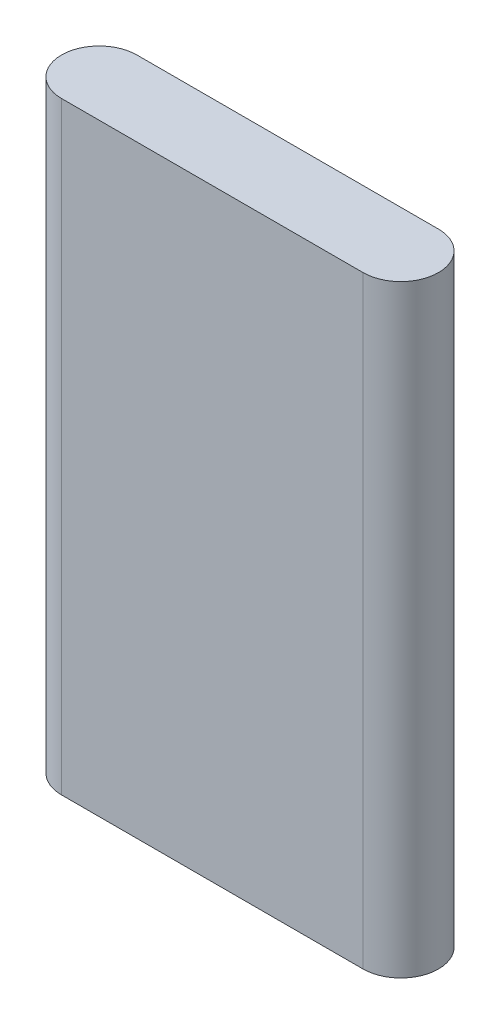
ISO-10303-21;
HEADER;
FILE_DESCRIPTION(('STEP AP214'),'2;1');
FILE_NAME('part.step','',(''),(''),'','','');
FILE_SCHEMA(('AUTOMOTIVE_DESIGN { 1 0 10303 214 1 1 1 1 }'));
ENDSEC;
DATA;
#1=APPLICATION_CONTEXT('core data for automotive mechanical design processes');
#2=APPLICATION_PROTOCOL_DEFINITION('international standard','automotive_design',2000,#1);
#3=PRODUCT_CONTEXT('',#1,'mechanical');
#4=PRODUCT('Part','Part','',(#3));
#5=PRODUCT_RELATED_PRODUCT_CATEGORY('part','',(#4));
#6=PRODUCT_DEFINITION_FORMATION('','',#4);
#7=PRODUCT_DEFINITION_CONTEXT('part definition',#1,'design');
#8=PRODUCT_DEFINITION('design','',#6,#7);
#9=PRODUCT_DEFINITION_SHAPE('','',#8);
#10=(LENGTH_UNIT() NAMED_UNIT(*) SI_UNIT(.MILLI.,.METRE.));
#11=(NAMED_UNIT(*) PLANE_ANGLE_UNIT() SI_UNIT($,.RADIAN.));
#12=(NAMED_UNIT(*) SI_UNIT($,.STERADIAN.) SOLID_ANGLE_UNIT());
#13=UNCERTAINTY_MEASURE_WITH_UNIT(LENGTH_MEASURE(1.E-05),#10,'distance_accuracy_value','');
#14=(GEOMETRIC_REPRESENTATION_CONTEXT(3) GLOBAL_UNCERTAINTY_ASSIGNED_CONTEXT((#13)) GLOBAL_UNIT_ASSIGNED_CONTEXT((#10,
#11,#12)) REPRESENTATION_CONTEXT('',''));
#15=CARTESIAN_POINT('',(0.,0.,0.));
#16=DIRECTION('',(0.,0.,1.));
#17=DIRECTION('',(1.,0.,0.));
#18=AXIS2_PLACEMENT_3D('',#15,#16,#17);
#19=CARTESIAN_POINT('',(-20.3145112125242,80.,0.));
#20=DIRECTION('',(0.,-1.,0.));
#21=DIRECTION('',(0.,0.,-1.));
#22=AXIS2_PLACEMENT_3D('',#19,#20,#21);
#23=CYLINDRICAL_SURFACE('',#22,5.);
#24=CARTESIAN_POINT('',(-20.3145112125242,0.,0.));
#25=DIRECTION('',(0.,1.,0.));
#26=DIRECTION('',(0.,0.,1.));
#27=AXIS2_PLACEMENT_3D('',#24,#25,#26);
#28=CIRCLE('',#27,5.);
#29=CARTESIAN_POINT('',(-20.3145112125242,0.,-5.));
#30=VERTEX_POINT('',#29);
#31=CARTESIAN_POINT('',(-20.3145112125242,0.,5.));
#32=VERTEX_POINT('',#31);
#33=EDGE_CURVE('E98',#30,#32,#28,.T.);
#34=ORIENTED_EDGE('',*,*,#33,.T.);
#35=DIRECTION('',(0.,-1.,0.));
#36=VECTOR('',#35,1.);
#37=CARTESIAN_POINT('',(-20.3145112125242,80.,5.));
#38=LINE('',#37,#36);
#39=CARTESIAN_POINT('',(-20.3145112125242,80.,5.));
#40=VERTEX_POINT('',#39);
#41=EDGE_CURVE('E11',#40,#32,#38,.T.);
#42=ORIENTED_EDGE('',*,*,#41,.F.);
#43=CARTESIAN_POINT('',(-20.3145112125242,80.,0.));
#44=DIRECTION('',(0.,1.,0.));
#45=DIRECTION('',(0.,0.,1.));
#46=AXIS2_PLACEMENT_3D('',#43,#44,#45);
#47=CIRCLE('',#46,5.);
#48=CARTESIAN_POINT('',(-20.3145112125242,80.,-5.));
#49=VERTEX_POINT('',#48);
#50=EDGE_CURVE('E86',#49,#40,#47,.T.);
#51=ORIENTED_EDGE('',*,*,#50,.F.);
#52=DIRECTION('',(0.,-1.,0.));
#53=VECTOR('',#52,1.);
#54=CARTESIAN_POINT('',(-20.3145112125242,80.,-5.));
#55=LINE('',#54,#53);
#56=EDGE_CURVE('E94',#49,#30,#55,.T.);
#57=ORIENTED_EDGE('',*,*,#56,.T.);
#58=EDGE_LOOP('',(#34,#42,#51,#57));
#59=FACE_BOUND('',#58,.T.);
#60=ADVANCED_FACE('F35',(#59),#23,.T.);
#61=CARTESIAN_POINT('',(-20.3145112125242,80.,5.));
#62=DIRECTION('',(0.,0.,-1.));
#63=DIRECTION('',(-1.,0.,0.));
#64=AXIS2_PLACEMENT_3D('',#61,#62,#63);
#65=PLANE('',#64);
#66=DIRECTION('',(1.,0.,0.));
#67=VECTOR('',#66,1.);
#68=CARTESIAN_POINT('',(-20.3145112125242,0.,5.));
#69=LINE('',#68,#67);
#70=CARTESIAN_POINT('',(19.6854887874758,0.,5.));
#71=VERTEX_POINT('',#70);
#72=EDGE_CURVE('E90',#32,#71,#69,.T.);
#73=ORIENTED_EDGE('',*,*,#72,.T.);
#74=DIRECTION('',(0.,-1.,0.));
#75=VECTOR('',#74,1.);
#76=CARTESIAN_POINT('',(19.6854887874758,80.,5.));
#77=LINE('',#76,#75);
#78=CARTESIAN_POINT('',(19.6854887874758,80.,5.));
#79=VERTEX_POINT('',#78);
#80=EDGE_CURVE('E43',#79,#71,#77,.T.);
#81=ORIENTED_EDGE('',*,*,#80,.F.);
#82=DIRECTION('',(1.,0.,0.));
#83=VECTOR('',#82,1.);
#84=CARTESIAN_POINT('',(-20.3145112125242,80.,5.));
#85=LINE('',#84,#83);
#86=EDGE_CURVE('E81',#40,#79,#85,.T.);
#87=ORIENTED_EDGE('',*,*,#86,.F.);
#88=ORIENTED_EDGE('',*,*,#41,.T.);
#89=EDGE_LOOP('',(#73,#81,#87,#88));
#90=FACE_BOUND('',#89,.T.);
#91=ADVANCED_FACE('F89',(#90),#65,.F.);
#92=CARTESIAN_POINT('',(19.6854887874758,80.,0.));
#93=DIRECTION('',(0.,-1.,0.));
#94=DIRECTION('',(0.,0.,-1.));
#95=AXIS2_PLACEMENT_3D('',#92,#93,#94);
#96=CYLINDRICAL_SURFACE('',#95,5.);
#97=CARTESIAN_POINT('',(19.6854887874758,0.,0.));
#98=DIRECTION('',(0.,1.,0.));
#99=DIRECTION('',(0.,0.,1.));
#100=AXIS2_PLACEMENT_3D('',#97,#98,#99);
#101=CIRCLE('',#100,5.);
#102=CARTESIAN_POINT('',(19.6854887874758,0.,-5.));
#103=VERTEX_POINT('',#102);
#104=EDGE_CURVE('E68',#71,#103,#101,.T.);
#105=ORIENTED_EDGE('',*,*,#104,.T.);
#106=DIRECTION('',(0.,-1.,0.));
#107=VECTOR('',#106,1.);
#108=CARTESIAN_POINT('',(19.6854887874758,80.,-5.));
#109=LINE('',#108,#107);
#110=CARTESIAN_POINT('',(19.6854887874758,80.,-5.));
#111=VERTEX_POINT('',#110);
#112=EDGE_CURVE('E91',#111,#103,#109,.T.);
#113=ORIENTED_EDGE('',*,*,#112,.F.);
#114=CARTESIAN_POINT('',(19.6854887874758,80.,0.));
#115=DIRECTION('',(0.,1.,0.));
#116=DIRECTION('',(0.,0.,1.));
#117=AXIS2_PLACEMENT_3D('',#114,#115,#116);
#118=CIRCLE('',#117,5.);
#119=EDGE_CURVE('E84',#79,#111,#118,.T.);
#120=ORIENTED_EDGE('',*,*,#119,.F.);
#121=ORIENTED_EDGE('',*,*,#80,.T.);
#122=EDGE_LOOP('',(#105,#113,#120,#121));
#123=FACE_BOUND('',#122,.T.);
#124=ADVANCED_FACE('F92',(#123),#96,.T.);
#125=CARTESIAN_POINT('',(-20.3145112125242,80.,-5.));
#126=DIRECTION('',(0.,0.,1.));
#127=DIRECTION('',(1.,0.,0.));
#128=AXIS2_PLACEMENT_3D('',#125,#126,#127);
#129=PLANE('',#128);
#130=DIRECTION('',(-1.,0.,0.));
#131=VECTOR('',#130,1.);
#132=CARTESIAN_POINT('',(-20.3145112125242,0.,-5.));
#133=LINE('',#132,#131);
#134=EDGE_CURVE('E74',#103,#30,#133,.T.);
#135=ORIENTED_EDGE('',*,*,#134,.T.);
#136=ORIENTED_EDGE('',*,*,#56,.F.);
#137=DIRECTION('',(-1.,0.,0.));
#138=VECTOR('',#137,1.);
#139=CARTESIAN_POINT('',(-20.3145112125242,80.,-5.));
#140=LINE('',#139,#138);
#141=EDGE_CURVE('E51',#111,#49,#140,.T.);
#142=ORIENTED_EDGE('',*,*,#141,.F.);
#143=ORIENTED_EDGE('',*,*,#112,.T.);
#144=EDGE_LOOP('',(#135,#136,#142,#143));
#145=FACE_BOUND('',#144,.T.);
#146=ADVANCED_FACE('F105',(#145),#129,.F.);
#147=CARTESIAN_POINT('',(-20.3145112125242,80.,0.));
#148=DIRECTION('',(0.,1.,0.));
#149=DIRECTION('',(0.,0.,1.));
#150=AXIS2_PLACEMENT_3D('',#147,#148,#149);
#151=PLANE('',#150);
#152=ORIENTED_EDGE('',*,*,#50,.T.);
#153=ORIENTED_EDGE('',*,*,#86,.T.);
#154=ORIENTED_EDGE('',*,*,#119,.T.);
#155=ORIENTED_EDGE('',*,*,#141,.T.);
#156=EDGE_LOOP('',(#152,#153,#154,#155));
#157=FACE_BOUND('',#156,.T.);
#158=ADVANCED_FACE('F82',(#157),#151,.T.);
#159=CARTESIAN_POINT('',(-20.3145112125242,0.,0.));
#160=DIRECTION('',(0.,1.,0.));
#161=DIRECTION('',(0.,0.,1.));
#162=AXIS2_PLACEMENT_3D('',#159,#160,#161);
#163=PLANE('',#162);
#164=ORIENTED_EDGE('',*,*,#33,.F.);
#165=ORIENTED_EDGE('',*,*,#134,.F.);
#166=ORIENTED_EDGE('',*,*,#104,.F.);
#167=ORIENTED_EDGE('',*,*,#72,.F.);
#168=EDGE_LOOP('',(#164,#165,#166,#167));
#169=FACE_BOUND('',#168,.T.);
#170=ADVANCED_FACE('F108',(#169),#163,.F.);
#171=CLOSED_SHELL('',(#60,#91,#124,#146,#158,#170));
#172=MANIFOLD_SOLID_BREP('B2',#171);
#173=ADVANCED_BREP_SHAPE_REPRESENTATION('',(#18,#172),#14);
#174=SHAPE_DEFINITION_REPRESENTATION(#9,#173);
ENDSEC;
END-ISO-10303-21;
